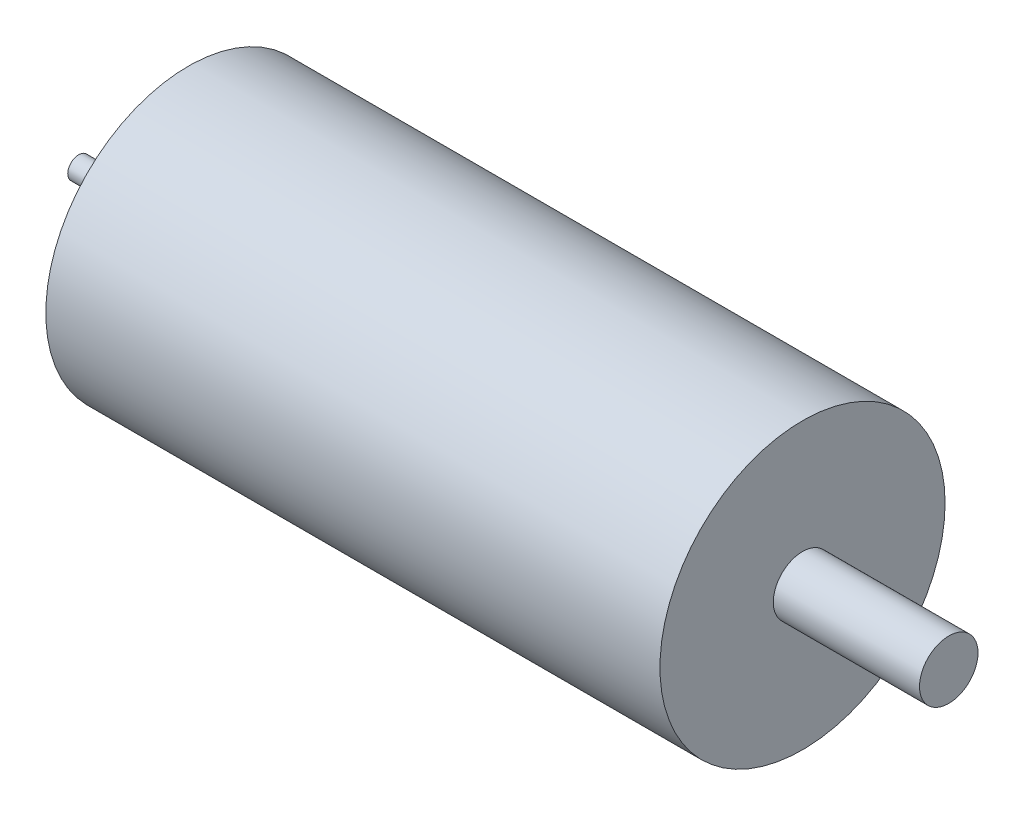
ISO-10303-21;
HEADER;
FILE_DESCRIPTION(('STEP AP214'),'2;1');
FILE_NAME('part.step','',(''),(''),'','','');
FILE_SCHEMA(('AUTOMOTIVE_DESIGN { 1 0 10303 214 1 1 1 1 }'));
ENDSEC;
DATA;
#1=APPLICATION_CONTEXT('core data for automotive mechanical design processes');
#2=APPLICATION_PROTOCOL_DEFINITION('international standard','automotive_design',2000,#1);
#3=PRODUCT_CONTEXT('',#1,'mechanical');
#4=PRODUCT('Part','Part','',(#3));
#5=PRODUCT_RELATED_PRODUCT_CATEGORY('part','',(#4));
#6=PRODUCT_DEFINITION_FORMATION('','',#4);
#7=PRODUCT_DEFINITION_CONTEXT('part definition',#1,'design');
#8=PRODUCT_DEFINITION('design','',#6,#7);
#9=PRODUCT_DEFINITION_SHAPE('','',#8);
#10=(LENGTH_UNIT() NAMED_UNIT(*) SI_UNIT(.MILLI.,.METRE.));
#11=(NAMED_UNIT(*) PLANE_ANGLE_UNIT() SI_UNIT($,.RADIAN.));
#12=(NAMED_UNIT(*) SI_UNIT($,.STERADIAN.) SOLID_ANGLE_UNIT());
#13=UNCERTAINTY_MEASURE_WITH_UNIT(LENGTH_MEASURE(1.E-05),#10,'distance_accuracy_value','');
#14=(GEOMETRIC_REPRESENTATION_CONTEXT(3) GLOBAL_UNCERTAINTY_ASSIGNED_CONTEXT((#13)) GLOBAL_UNIT_ASSIGNED_CONTEXT((#10,
#11,#12)) REPRESENTATION_CONTEXT('',''));
#15=CARTESIAN_POINT('',(0.,0.,0.));
#16=DIRECTION('',(0.,0.,1.));
#17=DIRECTION('',(1.,0.,0.));
#18=AXIS2_PLACEMENT_3D('',#15,#16,#17);
#19=CARTESIAN_POINT('',(84.,0.,0.));
#20=DIRECTION('',(-1.,0.,0.));
#21=DIRECTION('',(0.,0.,1.));
#22=AXIS2_PLACEMENT_3D('',#19,#20,#21);
#23=CYLINDRICAL_SURFACE('',#22,19.5);
#24=CARTESIAN_POINT('',(84.,0.,0.));
#25=DIRECTION('',(1.,0.,0.));
#26=DIRECTION('',(0.,0.,-1.));
#27=AXIS2_PLACEMENT_3D('',#24,#25,#26);
#28=CIRCLE('',#27,19.5);
#29=CARTESIAN_POINT('',(84.,0.,-19.5));
#30=VERTEX_POINT('',#29);
#31=EDGE_CURVE('E49',#30,#30,#28,.T.);
#32=ORIENTED_EDGE('',*,*,#31,.F.);
#33=EDGE_LOOP('',(#32));
#34=FACE_BOUND('',#33,.T.);
#35=CARTESIAN_POINT('',(0.,0.,0.));
#36=DIRECTION('',(1.,0.,0.));
#37=DIRECTION('',(0.,0.,-1.));
#38=AXIS2_PLACEMENT_3D('',#35,#36,#37);
#39=CIRCLE('',#38,19.5);
#40=CARTESIAN_POINT('',(0.,0.,-19.5));
#41=VERTEX_POINT('',#40);
#42=EDGE_CURVE('E55',#41,#41,#39,.T.);
#43=ORIENTED_EDGE('',*,*,#42,.T.);
#44=EDGE_LOOP('',(#43));
#45=FACE_BOUND('',#44,.T.);
#46=ADVANCED_FACE('F37',(#34,#45),#23,.T.);
#47=CARTESIAN_POINT('',(84.,0.,0.));
#48=DIRECTION('',(1.,0.,0.));
#49=DIRECTION('',(0.,0.,-1.));
#50=AXIS2_PLACEMENT_3D('',#47,#48,#49);
#51=PLANE('',#50);
#52=CARTESIAN_POINT('',(84.,0.,0.));
#53=DIRECTION('',(1.,0.,0.));
#54=DIRECTION('',(0.,0.,-1.));
#55=AXIS2_PLACEMENT_3D('',#52,#53,#54);
#56=CIRCLE('',#55,4.);
#57=CARTESIAN_POINT('',(84.,0.,-4.));
#58=VERTEX_POINT('',#57);
#59=EDGE_CURVE('E44',#58,#58,#56,.T.);
#60=ORIENTED_EDGE('',*,*,#59,.F.);
#61=EDGE_LOOP('',(#60));
#62=FACE_BOUND('',#61,.T.);
#63=ORIENTED_EDGE('',*,*,#31,.T.);
#64=EDGE_LOOP('',(#63));
#65=FACE_BOUND('',#64,.T.);
#66=ADVANCED_FACE('F87',(#62,#65),#51,.T.);
#67=CARTESIAN_POINT('',(0.,0.,0.));
#68=DIRECTION('',(1.,0.,0.));
#69=DIRECTION('',(0.,0.,-1.));
#70=AXIS2_PLACEMENT_3D('',#67,#68,#69);
#71=PLANE('',#70);
#72=CARTESIAN_POINT('',(0.,0.,0.));
#73=DIRECTION('',(1.,0.,0.));
#74=DIRECTION('',(0.,0.,-1.));
#75=AXIS2_PLACEMENT_3D('',#72,#73,#74);
#76=CIRCLE('',#75,1.5);
#77=CARTESIAN_POINT('',(0.,0.,-1.5));
#78=VERTEX_POINT('',#77);
#79=EDGE_CURVE('E10',#78,#78,#76,.F.);
#80=ORIENTED_EDGE('',*,*,#79,.F.);
#81=EDGE_LOOP('',(#80));
#82=FACE_BOUND('',#81,.T.);
#83=ORIENTED_EDGE('',*,*,#42,.F.);
#84=EDGE_LOOP('',(#83));
#85=FACE_BOUND('',#84,.T.);
#86=ADVANCED_FACE('F92',(#82,#85),#71,.F.);
#87=CARTESIAN_POINT('',(104.,0.,0.));
#88=DIRECTION('',(-1.,0.,0.));
#89=DIRECTION('',(0.,0.,1.));
#90=AXIS2_PLACEMENT_3D('',#87,#88,#89);
#91=CYLINDRICAL_SURFACE('',#90,4.);
#92=CARTESIAN_POINT('',(104.,0.,0.));
#93=DIRECTION('',(1.,0.,0.));
#94=DIRECTION('',(0.,0.,-1.));
#95=AXIS2_PLACEMENT_3D('',#92,#93,#94);
#96=CIRCLE('',#95,4.);
#97=CARTESIAN_POINT('',(104.,0.,-4.));
#98=VERTEX_POINT('',#97);
#99=EDGE_CURVE('E58',#98,#98,#96,.T.);
#100=ORIENTED_EDGE('',*,*,#99,.F.);
#101=EDGE_LOOP('',(#100));
#102=FACE_BOUND('',#101,.T.);
#103=ORIENTED_EDGE('',*,*,#59,.T.);
#104=EDGE_LOOP('',(#103));
#105=FACE_BOUND('',#104,.T.);
#106=ADVANCED_FACE('F84',(#102,#105),#91,.T.);
#107=CARTESIAN_POINT('',(104.,0.,0.));
#108=DIRECTION('',(1.,0.,0.));
#109=DIRECTION('',(0.,0.,-1.));
#110=AXIS2_PLACEMENT_3D('',#107,#108,#109);
#111=PLANE('',#110);
#112=ORIENTED_EDGE('',*,*,#99,.T.);
#113=EDGE_LOOP('',(#112));
#114=FACE_BOUND('',#113,.T.);
#115=ADVANCED_FACE('F77',(#114),#111,.T.);
#116=CARTESIAN_POINT('',(-15.,0.,0.));
#117=DIRECTION('',(1.,0.,0.));
#118=DIRECTION('',(0.,0.,-1.));
#119=AXIS2_PLACEMENT_3D('',#116,#117,#118);
#120=CYLINDRICAL_SURFACE('',#119,1.5);
#121=CARTESIAN_POINT('',(-15.,0.,0.));
#122=DIRECTION('',(-1.,0.,0.));
#123=DIRECTION('',(0.,0.,1.));
#124=AXIS2_PLACEMENT_3D('',#121,#122,#123);
#125=CIRCLE('',#124,1.5);
#126=CARTESIAN_POINT('',(-15.,0.,1.5));
#127=VERTEX_POINT('',#126);
#128=EDGE_CURVE('E66',#127,#127,#125,.T.);
#129=ORIENTED_EDGE('',*,*,#128,.F.);
#130=EDGE_LOOP('',(#129));
#131=FACE_BOUND('',#130,.T.);
#132=ORIENTED_EDGE('',*,*,#79,.T.);
#133=EDGE_LOOP('',(#132));
#134=FACE_BOUND('',#133,.T.);
#135=ADVANCED_FACE('F75',(#131,#134),#120,.T.);
#136=CARTESIAN_POINT('',(-15.,0.,0.));
#137=DIRECTION('',(-1.,0.,0.));
#138=DIRECTION('',(0.,0.,1.));
#139=AXIS2_PLACEMENT_3D('',#136,#137,#138);
#140=PLANE('',#139);
#141=ORIENTED_EDGE('',*,*,#128,.T.);
#142=EDGE_LOOP('',(#141));
#143=FACE_BOUND('',#142,.T.);
#144=ADVANCED_FACE('F73',(#143),#140,.T.);
#145=CLOSED_SHELL('',(#46,#66,#86,#106,#115,#135,#144));
#146=MANIFOLD_SOLID_BREP('B2',#145);
#147=ADVANCED_BREP_SHAPE_REPRESENTATION('',(#18,#146),#14);
#148=SHAPE_DEFINITION_REPRESENTATION(#9,#147);
ENDSEC;
END-ISO-10303-21;
